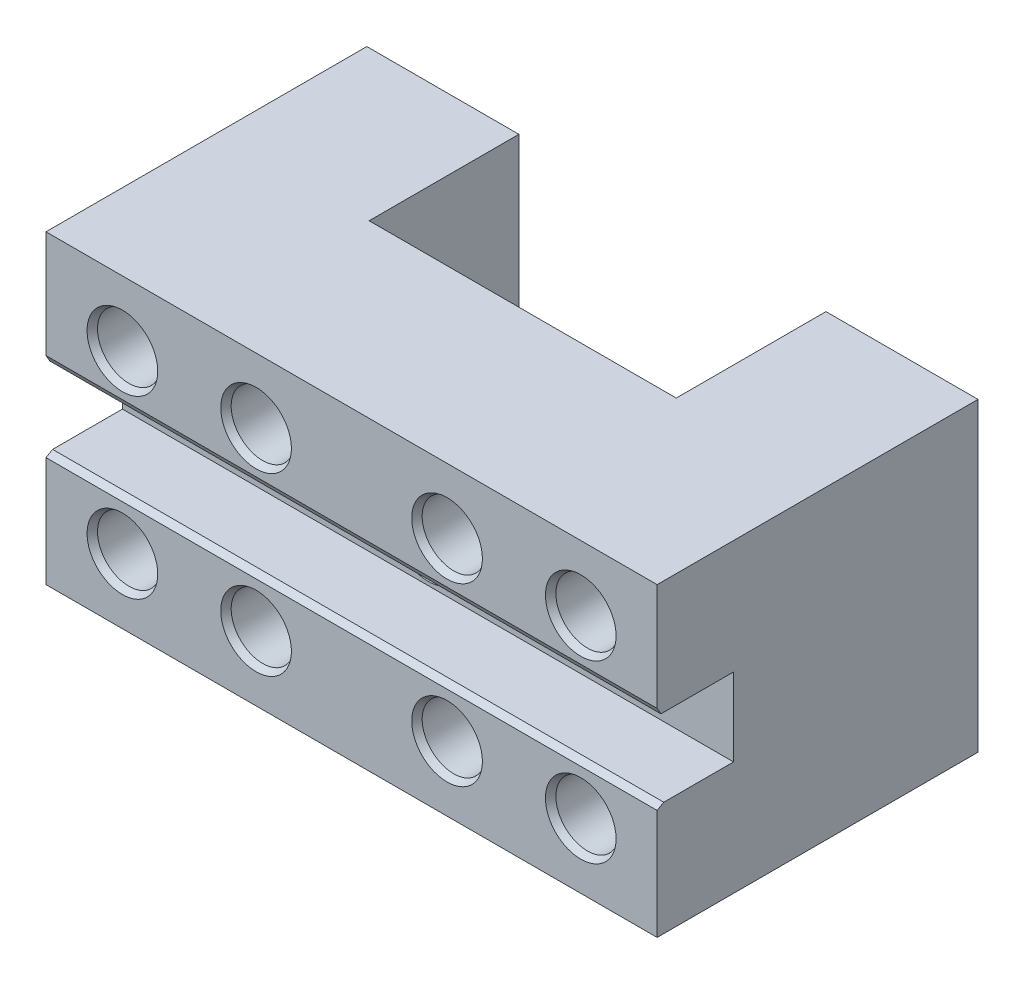
ISO-10303-21;
HEADER;
FILE_DESCRIPTION(('STEP AP214'),'2;1');
FILE_NAME('part.step','',(''),(''),'','','');
FILE_SCHEMA(('AUTOMOTIVE_DESIGN { 1 0 10303 214 1 1 1 1 }'));
ENDSEC;
DATA;
#1=APPLICATION_CONTEXT('core data for automotive mechanical design processes');
#2=APPLICATION_PROTOCOL_DEFINITION('international standard','automotive_design',2000,#1);
#3=PRODUCT_CONTEXT('',#1,'mechanical');
#4=PRODUCT('Part','Part','',(#3));
#5=PRODUCT_RELATED_PRODUCT_CATEGORY('part','',(#4));
#6=PRODUCT_DEFINITION_FORMATION('','',#4);
#7=PRODUCT_DEFINITION_CONTEXT('part definition',#1,'design');
#8=PRODUCT_DEFINITION('design','',#6,#7);
#9=PRODUCT_DEFINITION_SHAPE('','',#8);
#10=(LENGTH_UNIT() NAMED_UNIT(*) SI_UNIT(.MILLI.,.METRE.));
#11=(NAMED_UNIT(*) PLANE_ANGLE_UNIT() SI_UNIT($,.RADIAN.));
#12=(NAMED_UNIT(*) SI_UNIT($,.STERADIAN.) SOLID_ANGLE_UNIT());
#13=UNCERTAINTY_MEASURE_WITH_UNIT(LENGTH_MEASURE(1.E-05),#10,'distance_accuracy_value','');
#14=(GEOMETRIC_REPRESENTATION_CONTEXT(3) GLOBAL_UNCERTAINTY_ASSIGNED_CONTEXT((#13)) GLOBAL_UNIT_ASSIGNED_CONTEXT((#10,
#11,#12)) REPRESENTATION_CONTEXT('',''));
#15=CARTESIAN_POINT('',(0.,0.,0.));
#16=DIRECTION('',(0.,0.,1.));
#17=DIRECTION('',(1.,0.,0.));
#18=AXIS2_PLACEMENT_3D('',#15,#16,#17);
#19=CARTESIAN_POINT('',(-11.4121037463977,40.,-30.));
#20=DIRECTION('',(0.,0.,1.));
#21=DIRECTION('',(1.,0.,0.));
#22=AXIS2_PLACEMENT_3D('',#19,#20,#21);
#23=PLANE('',#22);
#24=CARTESIAN_POINT('',(-21.3121037463977,8.5,-30.));
#25=DIRECTION('',(0.,0.,1.));
#26=DIRECTION('',(1.,0.,0.));
#27=AXIS2_PLACEMENT_3D('',#24,#25,#26);
#28=CIRCLE('',#27,4.125);
#29=CARTESIAN_POINT('',(-17.1871037463977,8.5,-30.));
#30=VERTEX_POINT('',#29);
#31=EDGE_CURVE('E337',#30,#30,#28,.T.);
#32=ORIENTED_EDGE('',*,*,#31,.T.);
#33=EDGE_LOOP('',(#32));
#34=FACE_BOUND('',#33,.T.);
#35=CARTESIAN_POINT('',(-21.3121037463977,31.5,-30.));
#36=DIRECTION('',(0.,0.,1.));
#37=DIRECTION('',(1.,0.,0.));
#38=AXIS2_PLACEMENT_3D('',#35,#36,#37);
#39=CIRCLE('',#38,4.125);
#40=CARTESIAN_POINT('',(-17.1871037463977,31.5,-30.));
#41=VERTEX_POINT('',#40);
#42=EDGE_CURVE('E334',#41,#41,#39,.T.);
#43=ORIENTED_EDGE('',*,*,#42,.T.);
#44=EDGE_LOOP('',(#43));
#45=FACE_BOUND('',#44,.T.);
#46=DIRECTION('',(-1.,0.,0.));
#47=VECTOR('',#46,1.);
#48=CARTESIAN_POINT('',(-11.4121037463977,0.,-30.));
#49=LINE('',#48,#47);
#50=CARTESIAN_POINT('',(-11.4121037463977,0.,-30.));
#51=VERTEX_POINT('',#50);
#52=CARTESIAN_POINT('',(-31.3121037463977,0.,-30.));
#53=VERTEX_POINT('',#52);
#54=EDGE_CURVE('E203',#51,#53,#49,.T.);
#55=ORIENTED_EDGE('',*,*,#54,.T.);
#56=DIRECTION('',(0.,-1.,0.));
#57=VECTOR('',#56,1.);
#58=CARTESIAN_POINT('',(-31.3121037463977,40.,-30.));
#59=LINE('',#58,#57);
#60=CARTESIAN_POINT('',(-31.3121037463977,40.,-30.));
#61=VERTEX_POINT('',#60);
#62=EDGE_CURVE('E229',#61,#53,#59,.T.);
#63=ORIENTED_EDGE('',*,*,#62,.F.);
#64=DIRECTION('',(-1.,0.,0.));
#65=VECTOR('',#64,1.);
#66=CARTESIAN_POINT('',(-11.4121037463977,40.,-30.));
#67=LINE('',#66,#65);
#68=CARTESIAN_POINT('',(-11.4121037463977,40.,-30.));
#69=VERTEX_POINT('',#68);
#70=EDGE_CURVE('E191',#69,#61,#67,.T.);
#71=ORIENTED_EDGE('',*,*,#70,.F.);
#72=DIRECTION('',(0.,-1.,0.));
#73=VECTOR('',#72,1.);
#74=CARTESIAN_POINT('',(-11.4121037463977,40.,-30.));
#75=LINE('',#74,#73);
#76=EDGE_CURVE('E202',#69,#51,#75,.T.);
#77=ORIENTED_EDGE('',*,*,#76,.T.);
#78=EDGE_LOOP('',(#55,#63,#71,#77));
#79=FACE_BOUND('',#78,.T.);
#80=ADVANCED_FACE('F35',(#34,#45,#79),#23,.F.);
#81=CARTESIAN_POINT('',(-31.3121037463977,40.,-30.));
#82=DIRECTION('',(1.,0.,0.));
#83=DIRECTION('',(0.,0.,-1.));
#84=AXIS2_PLACEMENT_3D('',#81,#82,#83);
#85=PLANE('',#84);
#86=DIRECTION('',(0.,0.,1.));
#87=VECTOR('',#86,1.);
#88=CARTESIAN_POINT('',(-31.3121037463977,25.1,2.));
#89=LINE('',#88,#87);
#90=CARTESIAN_POINT('',(-31.3121037463977,25.1,2.));
#91=VERTEX_POINT('',#90);
#92=CARTESIAN_POINT('',(-31.3121037463977,25.1,11.5));
#93=VERTEX_POINT('',#92);
#94=EDGE_CURVE('E296',#91,#93,#89,.T.);
#95=ORIENTED_EDGE('',*,*,#94,.T.);
#96=DIRECTION('',(0.,-0.866025403784438,-0.500000000000001));
#97=VECTOR('',#96,1.);
#98=CARTESIAN_POINT('',(-31.3121037463977,25.9660254037844,12.));
#99=LINE('',#98,#97);
#100=CARTESIAN_POINT('',(-31.3121037463977,25.9660254037844,12.));
#101=VERTEX_POINT('',#100);
#102=EDGE_CURVE('E43',#93,#101,#99,.F.);
#103=ORIENTED_EDGE('',*,*,#102,.T.);
#104=DIRECTION('',(0.,1.,0.));
#105=VECTOR('',#104,1.);
#106=CARTESIAN_POINT('',(-31.3121037463977,25.1,12.));
#107=LINE('',#106,#105);
#108=CARTESIAN_POINT('',(-31.3121037463977,40.,12.));
#109=VERTEX_POINT('',#108);
#110=EDGE_CURVE('E186',#101,#109,#107,.T.);
#111=ORIENTED_EDGE('',*,*,#110,.T.);
#112=DIRECTION('',(0.,0.,1.));
#113=VECTOR('',#112,1.);
#114=CARTESIAN_POINT('',(-31.3121037463977,40.,-30.));
#115=LINE('',#114,#113);
#116=EDGE_CURVE('E149',#61,#109,#115,.T.);
#117=ORIENTED_EDGE('',*,*,#116,.F.);
#118=ORIENTED_EDGE('',*,*,#62,.T.);
#119=DIRECTION('',(0.,0.,1.));
#120=VECTOR('',#119,1.);
#121=CARTESIAN_POINT('',(-31.3121037463977,0.,-30.));
#122=LINE('',#121,#120);
#123=CARTESIAN_POINT('',(-31.3121037463977,0.,12.));
#124=VERTEX_POINT('',#123);
#125=EDGE_CURVE('E206',#53,#124,#122,.T.);
#126=ORIENTED_EDGE('',*,*,#125,.T.);
#127=DIRECTION('',(0.,1.,0.));
#128=VECTOR('',#127,1.);
#129=CARTESIAN_POINT('',(-31.3121037463977,0.,12.));
#130=LINE('',#129,#128);
#131=CARTESIAN_POINT('',(-31.3121037463977,14.4,12.));
#132=VERTEX_POINT('',#131);
#133=EDGE_CURVE('E174',#124,#132,#130,.T.);
#134=ORIENTED_EDGE('',*,*,#133,.T.);
#135=DIRECTION('',(0.,-0.499999999999999,0.86602540378444));
#136=VECTOR('',#135,1.);
#137=CARTESIAN_POINT('',(-31.3121037463977,14.9,11.1339745962156));
#138=LINE('',#137,#136);
#139=CARTESIAN_POINT('',(-31.3121037463977,14.9,11.1339745962156));
#140=VERTEX_POINT('',#139);
#141=EDGE_CURVE('E50',#132,#140,#138,.F.);
#142=ORIENTED_EDGE('',*,*,#141,.T.);
#143=DIRECTION('',(0.,0.,-1.));
#144=VECTOR('',#143,1.);
#145=CARTESIAN_POINT('',(-31.3121037463977,14.9,12.));
#146=LINE('',#145,#144);
#147=CARTESIAN_POINT('',(-31.3121037463977,14.9,2.));
#148=VERTEX_POINT('',#147);
#149=EDGE_CURVE('E312',#140,#148,#146,.T.);
#150=ORIENTED_EDGE('',*,*,#149,.T.);
#151=DIRECTION('',(0.,1.,0.));
#152=VECTOR('',#151,1.);
#153=CARTESIAN_POINT('',(-31.3121037463977,14.9,2.));
#154=LINE('',#153,#152);
#155=EDGE_CURVE('E319',#148,#91,#154,.T.);
#156=ORIENTED_EDGE('',*,*,#155,.T.);
#157=EDGE_LOOP('',(#95,#103,#111,#117,#118,#126,#134,#142,#150,#156));
#158=FACE_BOUND('',#157,.T.);
#159=ADVANCED_FACE('F295',(#158),#85,.F.);
#160=CARTESIAN_POINT('',(48.6878962536023,40.,0.));
#161=DIRECTION('',(-1.,0.,0.));
#162=DIRECTION('',(0.,0.,1.));
#163=AXIS2_PLACEMENT_3D('',#160,#161,#162);
#164=PLANE('',#163);
#165=DIRECTION('',(0.,-1.,0.));
#166=VECTOR('',#165,1.);
#167=CARTESIAN_POINT('',(48.6878962536023,25.1,12.));
#168=LINE('',#167,#166);
#169=CARTESIAN_POINT('',(48.6878962536023,40.,12.));
#170=VERTEX_POINT('',#169);
#171=CARTESIAN_POINT('',(48.6878962536023,25.9660254037844,12.));
#172=VERTEX_POINT('',#171);
#173=EDGE_CURVE('E143',#170,#172,#168,.T.);
#174=ORIENTED_EDGE('',*,*,#173,.T.);
#175=DIRECTION('',(0.,0.866025403784438,0.500000000000001));
#176=VECTOR('',#175,1.);
#177=CARTESIAN_POINT('',(48.6878962536023,25.9660254037844,12.));
#178=LINE('',#177,#176);
#179=CARTESIAN_POINT('',(48.6878962536023,25.1,11.5));
#180=VERTEX_POINT('',#179);
#181=EDGE_CURVE('E291',#172,#180,#178,.F.);
#182=ORIENTED_EDGE('',*,*,#181,.T.);
#183=DIRECTION('',(0.,0.,-1.));
#184=VECTOR('',#183,1.);
#185=CARTESIAN_POINT('',(48.6878962536023,25.1,2.));
#186=LINE('',#185,#184);
#187=CARTESIAN_POINT('',(48.6878962536023,25.1,2.));
#188=VERTEX_POINT('',#187);
#189=EDGE_CURVE('E165',#180,#188,#186,.T.);
#190=ORIENTED_EDGE('',*,*,#189,.T.);
#191=DIRECTION('',(0.,-1.,0.));
#192=VECTOR('',#191,1.);
#193=CARTESIAN_POINT('',(48.6878962536023,14.9,2.));
#194=LINE('',#193,#192);
#195=CARTESIAN_POINT('',(48.6878962536023,14.9,2.));
#196=VERTEX_POINT('',#195);
#197=EDGE_CURVE('E168',#188,#196,#194,.T.);
#198=ORIENTED_EDGE('',*,*,#197,.T.);
#199=DIRECTION('',(0.,0.,1.));
#200=VECTOR('',#199,1.);
#201=CARTESIAN_POINT('',(48.6878962536023,14.9,12.));
#202=LINE('',#201,#200);
#203=CARTESIAN_POINT('',(48.6878962536023,14.9,11.1339745962156));
#204=VERTEX_POINT('',#203);
#205=EDGE_CURVE('E179',#196,#204,#202,.T.);
#206=ORIENTED_EDGE('',*,*,#205,.T.);
#207=DIRECTION('',(0.,0.499999999999999,-0.86602540378444));
#208=VECTOR('',#207,1.);
#209=CARTESIAN_POINT('',(48.6878962536023,14.9,11.1339745962156));
#210=LINE('',#209,#208);
#211=CARTESIAN_POINT('',(48.6878962536023,14.4,12.));
#212=VERTEX_POINT('',#211);
#213=EDGE_CURVE('E289',#204,#212,#210,.F.);
#214=ORIENTED_EDGE('',*,*,#213,.T.);
#215=DIRECTION('',(0.,-1.,0.));
#216=VECTOR('',#215,1.);
#217=CARTESIAN_POINT('',(48.6878962536023,0.,12.));
#218=LINE('',#217,#216);
#219=CARTESIAN_POINT('',(48.6878962536023,0.,12.));
#220=VERTEX_POINT('',#219);
#221=EDGE_CURVE('E159',#212,#220,#218,.T.);
#222=ORIENTED_EDGE('',*,*,#221,.T.);
#223=DIRECTION('',(0.,0.,-1.));
#224=VECTOR('',#223,1.);
#225=CARTESIAN_POINT('',(48.6878962536023,0.,0.));
#226=LINE('',#225,#224);
#227=CARTESIAN_POINT('',(48.6878962536023,0.,-30.));
#228=VERTEX_POINT('',#227);
#229=EDGE_CURVE('E208',#220,#228,#226,.T.);
#230=ORIENTED_EDGE('',*,*,#229,.T.);
#231=DIRECTION('',(0.,-1.,0.));
#232=VECTOR('',#231,1.);
#233=CARTESIAN_POINT('',(48.6878962536023,40.,-30.));
#234=LINE('',#233,#232);
#235=CARTESIAN_POINT('',(48.6878962536023,40.,-30.));
#236=VERTEX_POINT('',#235);
#237=EDGE_CURVE('E145',#236,#228,#234,.T.);
#238=ORIENTED_EDGE('',*,*,#237,.F.);
#239=DIRECTION('',(0.,0.,-1.));
#240=VECTOR('',#239,1.);
#241=CARTESIAN_POINT('',(48.6878962536023,40.,0.));
#242=LINE('',#241,#240);
#243=EDGE_CURVE('E139',#170,#236,#242,.T.);
#244=ORIENTED_EDGE('',*,*,#243,.F.);
#245=EDGE_LOOP('',(#174,#182,#190,#198,#206,#214,#222,#230,#238,#244));
#246=FACE_BOUND('',#245,.T.);
#247=ADVANCED_FACE('F141',(#246),#164,.F.);
#248=CARTESIAN_POINT('',(48.6878962536023,40.,-30.));
#249=DIRECTION('',(0.,0.,1.));
#250=DIRECTION('',(1.,0.,0.));
#251=AXIS2_PLACEMENT_3D('',#248,#249,#250);
#252=PLANE('',#251);
#253=CARTESIAN_POINT('',(38.6878962536023,31.5,-30.));
#254=DIRECTION('',(0.,0.,1.));
#255=DIRECTION('',(1.,0.,0.));
#256=AXIS2_PLACEMENT_3D('',#253,#254,#255);
#257=CIRCLE('',#256,4.12500000000001);
#258=CARTESIAN_POINT('',(42.8128962536023,31.5,-30.));
#259=VERTEX_POINT('',#258);
#260=EDGE_CURVE('E338',#259,#259,#257,.T.);
#261=ORIENTED_EDGE('',*,*,#260,.T.);
#262=EDGE_LOOP('',(#261));
#263=FACE_BOUND('',#262,.T.);
#264=CARTESIAN_POINT('',(38.6878962536023,8.50000000000001,-30.));
#265=DIRECTION('',(0.,0.,1.));
#266=DIRECTION('',(1.,0.,0.));
#267=AXIS2_PLACEMENT_3D('',#264,#265,#266);
#268=CIRCLE('',#267,4.12500000000001);
#269=CARTESIAN_POINT('',(42.8128962536023,8.50000000000001,-30.));
#270=VERTEX_POINT('',#269);
#271=EDGE_CURVE('E341',#270,#270,#268,.T.);
#272=ORIENTED_EDGE('',*,*,#271,.T.);
#273=EDGE_LOOP('',(#272));
#274=FACE_BOUND('',#273,.T.);
#275=DIRECTION('',(-1.,0.,0.));
#276=VECTOR('',#275,1.);
#277=CARTESIAN_POINT('',(48.6878962536023,0.,-30.));
#278=LINE('',#277,#276);
#279=CARTESIAN_POINT('',(28.7878962536023,0.,-30.));
#280=VERTEX_POINT('',#279);
#281=EDGE_CURVE('E210',#228,#280,#278,.T.);
#282=ORIENTED_EDGE('',*,*,#281,.T.);
#283=DIRECTION('',(0.,-1.,0.));
#284=VECTOR('',#283,1.);
#285=CARTESIAN_POINT('',(28.7878962536023,40.,-30.));
#286=LINE('',#285,#284);
#287=CARTESIAN_POINT('',(28.7878962536023,40.,-30.));
#288=VERTEX_POINT('',#287);
#289=EDGE_CURVE('E225',#288,#280,#286,.T.);
#290=ORIENTED_EDGE('',*,*,#289,.F.);
#291=DIRECTION('',(-1.,0.,0.));
#292=VECTOR('',#291,1.);
#293=CARTESIAN_POINT('',(48.6878962536023,40.,-30.));
#294=LINE('',#293,#292);
#295=EDGE_CURVE('E148',#236,#288,#294,.T.);
#296=ORIENTED_EDGE('',*,*,#295,.F.);
#297=ORIENTED_EDGE('',*,*,#237,.T.);
#298=EDGE_LOOP('',(#282,#290,#296,#297));
#299=FACE_BOUND('',#298,.T.);
#300=ADVANCED_FACE('F631',(#263,#274,#299),#252,.F.);
#301=CARTESIAN_POINT('',(28.7878962536023,40.,-30.));
#302=DIRECTION('',(1.,0.,0.));
#303=DIRECTION('',(0.,0.,-1.));
#304=AXIS2_PLACEMENT_3D('',#301,#302,#303);
#305=PLANE('',#304);
#306=DIRECTION('',(0.,0.,1.));
#307=VECTOR('',#306,1.);
#308=CARTESIAN_POINT('',(28.7878962536023,0.,-30.));
#309=LINE('',#308,#307);
#310=CARTESIAN_POINT('',(28.7878962536023,0.,-10.4));
#311=VERTEX_POINT('',#310);
#312=EDGE_CURVE('E212',#280,#311,#309,.T.);
#313=ORIENTED_EDGE('',*,*,#312,.T.);
#314=DIRECTION('',(0.,-1.,0.));
#315=VECTOR('',#314,1.);
#316=CARTESIAN_POINT('',(28.7878962536023,40.,-10.4));
#317=LINE('',#316,#315);
#318=CARTESIAN_POINT('',(28.7878962536023,40.,-10.4));
#319=VERTEX_POINT('',#318);
#320=EDGE_CURVE('E222',#319,#311,#317,.T.);
#321=ORIENTED_EDGE('',*,*,#320,.F.);
#322=DIRECTION('',(0.,0.,1.));
#323=VECTOR('',#322,1.);
#324=CARTESIAN_POINT('',(28.7878962536023,40.,-30.));
#325=LINE('',#324,#323);
#326=EDGE_CURVE('E196',#288,#319,#325,.T.);
#327=ORIENTED_EDGE('',*,*,#326,.F.);
#328=ORIENTED_EDGE('',*,*,#289,.T.);
#329=EDGE_LOOP('',(#313,#321,#327,#328));
#330=FACE_BOUND('',#329,.T.);
#331=ADVANCED_FACE('F623',(#330),#305,.F.);
#332=CARTESIAN_POINT('',(28.7878962536023,40.,-10.4));
#333=DIRECTION('',(0.,0.,1.));
#334=DIRECTION('',(1.,0.,0.));
#335=AXIS2_PLACEMENT_3D('',#332,#333,#334);
#336=PLANE('',#335);
#337=CARTESIAN_POINT('',(8.68789625360231,20.,-10.4));
#338=DIRECTION('',(0.,0.,1.));
#339=DIRECTION('',(1.,0.,0.));
#340=AXIS2_PLACEMENT_3D('',#337,#338,#339);
#341=CIRCLE('',#340,4.125);
#342=CARTESIAN_POINT('',(12.8128962536023,20.,-10.4));
#343=VERTEX_POINT('',#342);
#344=EDGE_CURVE('E328',#343,#343,#341,.T.);
#345=ORIENTED_EDGE('',*,*,#344,.T.);
#346=EDGE_LOOP('',(#345));
#347=FACE_BOUND('',#346,.T.);
#348=CARTESIAN_POINT('',(-3.8121037463977,8.50000000000001,-10.4));
#349=DIRECTION('',(0.,0.,1.));
#350=DIRECTION('',(1.,0.,0.));
#351=AXIS2_PLACEMENT_3D('',#348,#349,#350);
#352=CIRCLE('',#351,4.125);
#353=CARTESIAN_POINT('',(0.312896253602301,8.50000000000001,-10.4));
#354=VERTEX_POINT('',#353);
#355=EDGE_CURVE('E171',#354,#354,#352,.T.);
#356=ORIENTED_EDGE('',*,*,#355,.T.);
#357=EDGE_LOOP('',(#356));
#358=FACE_BOUND('',#357,.T.);
#359=CARTESIAN_POINT('',(21.1878962536023,8.50000000000001,-10.4));
#360=DIRECTION('',(0.,0.,1.));
#361=DIRECTION('',(1.,0.,0.));
#362=AXIS2_PLACEMENT_3D('',#359,#360,#361);
#363=CIRCLE('',#362,4.125);
#364=CARTESIAN_POINT('',(25.3128962536023,8.50000000000001,-10.4));
#365=VERTEX_POINT('',#364);
#366=EDGE_CURVE('E325',#365,#365,#363,.T.);
#367=ORIENTED_EDGE('',*,*,#366,.T.);
#368=EDGE_LOOP('',(#367));
#369=FACE_BOUND('',#368,.T.);
#370=CARTESIAN_POINT('',(21.1878962536023,31.5,-10.4));
#371=DIRECTION('',(0.,0.,1.));
#372=DIRECTION('',(1.,0.,0.));
#373=AXIS2_PLACEMENT_3D('',#370,#371,#372);
#374=CIRCLE('',#373,4.125);
#375=CARTESIAN_POINT('',(25.3128962536023,31.5,-10.4));
#376=VERTEX_POINT('',#375);
#377=EDGE_CURVE('E331',#376,#376,#374,.T.);
#378=ORIENTED_EDGE('',*,*,#377,.T.);
#379=EDGE_LOOP('',(#378));
#380=FACE_BOUND('',#379,.T.);
#381=CARTESIAN_POINT('',(-3.8121037463977,31.5,-10.4));
#382=DIRECTION('',(0.,0.,1.));
#383=DIRECTION('',(1.,0.,0.));
#384=AXIS2_PLACEMENT_3D('',#381,#382,#383);
#385=CIRCLE('',#384,4.125);
#386=CARTESIAN_POINT('',(0.312896253602301,31.5,-10.4));
#387=VERTEX_POINT('',#386);
#388=EDGE_CURVE('E166',#387,#387,#385,.T.);
#389=ORIENTED_EDGE('',*,*,#388,.T.);
#390=EDGE_LOOP('',(#389));
#391=FACE_BOUND('',#390,.T.);
#392=DIRECTION('',(-1.,0.,0.));
#393=VECTOR('',#392,1.);
#394=CARTESIAN_POINT('',(28.7878962536023,0.,-10.4));
#395=LINE('',#394,#393);
#396=CARTESIAN_POINT('',(-11.4121037463977,0.,-10.4));
#397=VERTEX_POINT('',#396);
#398=EDGE_CURVE('E214',#311,#397,#395,.T.);
#399=ORIENTED_EDGE('',*,*,#398,.T.);
#400=DIRECTION('',(0.,-1.,0.));
#401=VECTOR('',#400,1.);
#402=CARTESIAN_POINT('',(-11.4121037463977,40.,-10.4));
#403=LINE('',#402,#401);
#404=CARTESIAN_POINT('',(-11.4121037463977,40.,-10.4));
#405=VERTEX_POINT('',#404);
#406=EDGE_CURVE('E219',#405,#397,#403,.T.);
#407=ORIENTED_EDGE('',*,*,#406,.F.);
#408=DIRECTION('',(-1.,0.,0.));
#409=VECTOR('',#408,1.);
#410=CARTESIAN_POINT('',(28.7878962536023,40.,-10.4));
#411=LINE('',#410,#409);
#412=EDGE_CURVE('E198',#319,#405,#411,.T.);
#413=ORIENTED_EDGE('',*,*,#412,.F.);
#414=ORIENTED_EDGE('',*,*,#320,.T.);
#415=EDGE_LOOP('',(#399,#407,#413,#414));
#416=FACE_BOUND('',#415,.T.);
#417=ADVANCED_FACE('F614',(#347,#358,#369,#380,#391,#416),#336,.F.);
#418=CARTESIAN_POINT('',(-11.4121037463977,40.,-10.4));
#419=DIRECTION('',(-1.,0.,0.));
#420=DIRECTION('',(0.,0.,1.));
#421=AXIS2_PLACEMENT_3D('',#418,#419,#420);
#422=PLANE('',#421);
#423=DIRECTION('',(0.,0.,-1.));
#424=VECTOR('',#423,1.);
#425=CARTESIAN_POINT('',(-11.4121037463977,0.,-10.4));
#426=LINE('',#425,#424);
#427=EDGE_CURVE('E193',#397,#51,#426,.T.);
#428=ORIENTED_EDGE('',*,*,#427,.T.);
#429=ORIENTED_EDGE('',*,*,#76,.F.);
#430=DIRECTION('',(0.,0.,-1.));
#431=VECTOR('',#430,1.);
#432=CARTESIAN_POINT('',(-11.4121037463977,40.,-10.4));
#433=LINE('',#432,#431);
#434=EDGE_CURVE('E200',#405,#69,#433,.T.);
#435=ORIENTED_EDGE('',*,*,#434,.F.);
#436=ORIENTED_EDGE('',*,*,#406,.T.);
#437=EDGE_LOOP('',(#428,#429,#435,#436));
#438=FACE_BOUND('',#437,.T.);
#439=ADVANCED_FACE('F607',(#438),#422,.F.);
#440=CARTESIAN_POINT('',(0.,40.,0.));
#441=DIRECTION('',(0.,1.,0.));
#442=DIRECTION('',(0.,0.,1.));
#443=AXIS2_PLACEMENT_3D('',#440,#441,#442);
#444=PLANE('',#443);
#445=ORIENTED_EDGE('',*,*,#70,.T.);
#446=ORIENTED_EDGE('',*,*,#116,.T.);
#447=DIRECTION('',(1.,0.,0.));
#448=VECTOR('',#447,1.);
#449=CARTESIAN_POINT('',(-73.0733297820399,40.,12.));
#450=LINE('',#449,#448);
#451=EDGE_CURVE('E153',#109,#170,#450,.T.);
#452=ORIENTED_EDGE('',*,*,#451,.T.);
#453=ORIENTED_EDGE('',*,*,#243,.T.);
#454=ORIENTED_EDGE('',*,*,#295,.T.);
#455=ORIENTED_EDGE('',*,*,#326,.T.);
#456=ORIENTED_EDGE('',*,*,#412,.T.);
#457=ORIENTED_EDGE('',*,*,#434,.T.);
#458=EDGE_LOOP('',(#445,#446,#452,#453,#454,#455,#456,#457));
#459=FACE_BOUND('',#458,.T.);
#460=ADVANCED_FACE('F155',(#459),#444,.T.);
#461=CARTESIAN_POINT('',(0.,0.,0.));
#462=DIRECTION('',(0.,1.,0.));
#463=DIRECTION('',(0.,0.,1.));
#464=AXIS2_PLACEMENT_3D('',#461,#462,#463);
#465=PLANE('',#464);
#466=ORIENTED_EDGE('',*,*,#54,.F.);
#467=ORIENTED_EDGE('',*,*,#427,.F.);
#468=ORIENTED_EDGE('',*,*,#398,.F.);
#469=ORIENTED_EDGE('',*,*,#312,.F.);
#470=ORIENTED_EDGE('',*,*,#281,.F.);
#471=ORIENTED_EDGE('',*,*,#229,.F.);
#472=DIRECTION('',(1.,0.,0.));
#473=VECTOR('',#472,1.);
#474=CARTESIAN_POINT('',(-73.0733297820399,0.,12.));
#475=LINE('',#474,#473);
#476=EDGE_CURVE('E183',#124,#220,#475,.T.);
#477=ORIENTED_EDGE('',*,*,#476,.F.);
#478=ORIENTED_EDGE('',*,*,#125,.F.);
#479=EDGE_LOOP('',(#466,#467,#468,#469,#470,#471,#477,#478));
#480=FACE_BOUND('',#479,.T.);
#481=ADVANCED_FACE('F590',(#480),#465,.F.);
#482=CARTESIAN_POINT('',(-73.0733297820399,0.,12.));
#483=DIRECTION('',(0.,0.,1.));
#484=DIRECTION('',(1.,0.,0.));
#485=AXIS2_PLACEMENT_3D('',#482,#483,#484);
#486=PLANE('',#485);
#487=CARTESIAN_POINT('',(38.6878962536023,8.50000000000001,12.));
#488=DIRECTION('',(0.,0.,1.));
#489=DIRECTION('',(1.,0.,0.));
#490=AXIS2_PLACEMENT_3D('',#487,#488,#489);
#491=CIRCLE('',#490,4.62500000000001);
#492=CARTESIAN_POINT('',(43.3128962536023,8.50000000000001,12.));
#493=VERTEX_POINT('',#492);
#494=EDGE_CURVE('E246',#493,#493,#491,.F.);
#495=ORIENTED_EDGE('',*,*,#494,.T.);
#496=EDGE_LOOP('',(#495));
#497=FACE_BOUND('',#496,.T.);
#498=CARTESIAN_POINT('',(21.1878962536023,8.50000000000001,12.));
#499=DIRECTION('',(0.,0.,1.));
#500=DIRECTION('',(1.,0.,0.));
#501=AXIS2_PLACEMENT_3D('',#498,#499,#500);
#502=CIRCLE('',#501,4.62500000000001);
#503=CARTESIAN_POINT('',(25.8128962536023,8.50000000000001,12.));
#504=VERTEX_POINT('',#503);
#505=EDGE_CURVE('E243',#504,#504,#502,.F.);
#506=ORIENTED_EDGE('',*,*,#505,.T.);
#507=EDGE_LOOP('',(#506));
#508=FACE_BOUND('',#507,.T.);
#509=CARTESIAN_POINT('',(-3.8121037463977,8.50000000000001,12.));
#510=DIRECTION('',(0.,0.,1.));
#511=DIRECTION('',(1.,0.,0.));
#512=AXIS2_PLACEMENT_3D('',#509,#510,#511);
#513=CIRCLE('',#512,4.62500000000001);
#514=CARTESIAN_POINT('',(0.812896253602311,8.50000000000001,12.));
#515=VERTEX_POINT('',#514);
#516=EDGE_CURVE('E240',#515,#515,#513,.F.);
#517=ORIENTED_EDGE('',*,*,#516,.T.);
#518=EDGE_LOOP('',(#517));
#519=FACE_BOUND('',#518,.T.);
#520=CARTESIAN_POINT('',(-21.3121037463977,8.5,12.));
#521=DIRECTION('',(0.,0.,1.));
#522=DIRECTION('',(1.,0.,0.));
#523=AXIS2_PLACEMENT_3D('',#520,#521,#522);
#524=CIRCLE('',#523,4.62500000000001);
#525=CARTESIAN_POINT('',(-16.6871037463977,8.5,12.));
#526=VERTEX_POINT('',#525);
#527=EDGE_CURVE('E237',#526,#526,#524,.F.);
#528=ORIENTED_EDGE('',*,*,#527,.T.);
#529=EDGE_LOOP('',(#528));
#530=FACE_BOUND('',#529,.T.);
#531=ORIENTED_EDGE('',*,*,#221,.F.);
#532=DIRECTION('',(-1.,0.,0.));
#533=VECTOR('',#532,1.);
#534=CARTESIAN_POINT('',(-73.0733297820399,14.4,12.));
#535=LINE('',#534,#533);
#536=EDGE_CURVE('E235',#212,#132,#535,.T.);
#537=ORIENTED_EDGE('',*,*,#536,.T.);
#538=ORIENTED_EDGE('',*,*,#133,.F.);
#539=ORIENTED_EDGE('',*,*,#476,.T.);
#540=EDGE_LOOP('',(#531,#537,#538,#539));
#541=FACE_BOUND('',#540,.T.);
#542=ADVANCED_FACE('F317',(#497,#508,#519,#530,#541),#486,.T.);
#543=CARTESIAN_POINT('',(-73.0733297820399,14.9,12.));
#544=DIRECTION('',(0.,1.,0.));
#545=DIRECTION('',(0.,0.,1.));
#546=AXIS2_PLACEMENT_3D('',#543,#544,#545);
#547=PLANE('',#546);
#548=ORIENTED_EDGE('',*,*,#149,.F.);
#549=DIRECTION('',(1.,0.,0.));
#550=VECTOR('',#549,1.);
#551=CARTESIAN_POINT('',(-73.0733297820399,14.9,11.1339745962156));
#552=LINE('',#551,#550);
#553=EDGE_CURVE('E11',#140,#204,#552,.T.);
#554=ORIENTED_EDGE('',*,*,#553,.T.);
#555=ORIENTED_EDGE('',*,*,#205,.F.);
#556=DIRECTION('',(1.,0.,0.));
#557=VECTOR('',#556,1.);
#558=CARTESIAN_POINT('',(-73.0733297820399,14.9,2.));
#559=LINE('',#558,#557);
#560=EDGE_CURVE('E187',#148,#196,#559,.T.);
#561=ORIENTED_EDGE('',*,*,#560,.F.);
#562=EDGE_LOOP('',(#548,#554,#555,#561));
#563=FACE_BOUND('',#562,.T.);
#564=ADVANCED_FACE('F310',(#563),#547,.T.);
#565=CARTESIAN_POINT('',(-73.0733297820399,14.9,2.));
#566=DIRECTION('',(0.,0.,1.));
#567=DIRECTION('',(1.,0.,0.));
#568=AXIS2_PLACEMENT_3D('',#565,#566,#567);
#569=PLANE('',#568);
#570=CARTESIAN_POINT('',(8.68789625360231,20.,2.));
#571=DIRECTION('',(0.,0.,1.));
#572=DIRECTION('',(1.,0.,0.));
#573=AXIS2_PLACEMENT_3D('',#570,#571,#572);
#574=CIRCLE('',#573,4.62500000000001);
#575=CARTESIAN_POINT('',(13.3128962536023,20.,2.));
#576=VERTEX_POINT('',#575);
#577=EDGE_CURVE('E277',#576,#576,#574,.F.);
#578=ORIENTED_EDGE('',*,*,#577,.T.);
#579=EDGE_LOOP('',(#578));
#580=FACE_BOUND('',#579,.T.);
#581=ORIENTED_EDGE('',*,*,#155,.F.);
#582=ORIENTED_EDGE('',*,*,#560,.T.);
#583=ORIENTED_EDGE('',*,*,#197,.F.);
#584=DIRECTION('',(1.,0.,0.));
#585=VECTOR('',#584,1.);
#586=CARTESIAN_POINT('',(-73.0733297820399,25.1,2.));
#587=LINE('',#586,#585);
#588=EDGE_CURVE('E158',#91,#188,#587,.T.);
#589=ORIENTED_EDGE('',*,*,#588,.F.);
#590=EDGE_LOOP('',(#581,#582,#583,#589));
#591=FACE_BOUND('',#590,.T.);
#592=ADVANCED_FACE('F305',(#580,#591),#569,.T.);
#593=CARTESIAN_POINT('',(-73.0733297820399,25.1,2.));
#594=DIRECTION('',(0.,-1.,0.));
#595=DIRECTION('',(0.,0.,-1.));
#596=AXIS2_PLACEMENT_3D('',#593,#594,#595);
#597=PLANE('',#596);
#598=ORIENTED_EDGE('',*,*,#189,.F.);
#599=DIRECTION('',(-1.,0.,0.));
#600=VECTOR('',#599,1.);
#601=CARTESIAN_POINT('',(-73.0733297820399,25.1,11.5));
#602=LINE('',#601,#600);
#603=EDGE_CURVE('E58',#180,#93,#602,.T.);
#604=ORIENTED_EDGE('',*,*,#603,.T.);
#605=ORIENTED_EDGE('',*,*,#94,.F.);
#606=ORIENTED_EDGE('',*,*,#588,.T.);
#607=EDGE_LOOP('',(#598,#604,#605,#606));
#608=FACE_BOUND('',#607,.T.);
#609=ADVANCED_FACE('F300',(#608),#597,.T.);
#610=CARTESIAN_POINT('',(-73.0733297820399,25.1,12.));
#611=DIRECTION('',(0.,0.,1.));
#612=DIRECTION('',(1.,0.,0.));
#613=AXIS2_PLACEMENT_3D('',#610,#611,#612);
#614=PLANE('',#613);
#615=CARTESIAN_POINT('',(38.6878962536023,31.5,12.));
#616=DIRECTION('',(0.,0.,1.));
#617=DIRECTION('',(1.,0.,0.));
#618=AXIS2_PLACEMENT_3D('',#615,#616,#617);
#619=CIRCLE('',#618,4.62500000000001);
#620=CARTESIAN_POINT('',(43.3128962536023,31.5,12.));
#621=VERTEX_POINT('',#620);
#622=EDGE_CURVE('E262',#621,#621,#619,.F.);
#623=ORIENTED_EDGE('',*,*,#622,.T.);
#624=EDGE_LOOP('',(#623));
#625=FACE_BOUND('',#624,.T.);
#626=CARTESIAN_POINT('',(21.1878962536023,31.5,12.));
#627=DIRECTION('',(0.,0.,1.));
#628=DIRECTION('',(1.,0.,0.));
#629=AXIS2_PLACEMENT_3D('',#626,#627,#628);
#630=CIRCLE('',#629,4.62500000000001);
#631=CARTESIAN_POINT('',(25.8128962536023,31.5,12.));
#632=VERTEX_POINT('',#631);
#633=EDGE_CURVE('E259',#632,#632,#630,.F.);
#634=ORIENTED_EDGE('',*,*,#633,.T.);
#635=EDGE_LOOP('',(#634));
#636=FACE_BOUND('',#635,.T.);
#637=CARTESIAN_POINT('',(-3.8121037463977,31.5,12.));
#638=DIRECTION('',(0.,0.,1.));
#639=DIRECTION('',(1.,0.,0.));
#640=AXIS2_PLACEMENT_3D('',#637,#638,#639);
#641=CIRCLE('',#640,4.62500000000001);
#642=CARTESIAN_POINT('',(0.812896253602313,31.5,12.));
#643=VERTEX_POINT('',#642);
#644=EDGE_CURVE('E256',#643,#643,#641,.F.);
#645=ORIENTED_EDGE('',*,*,#644,.T.);
#646=EDGE_LOOP('',(#645));
#647=FACE_BOUND('',#646,.T.);
#648=CARTESIAN_POINT('',(-21.3121037463977,31.5,12.));
#649=DIRECTION('',(0.,0.,1.));
#650=DIRECTION('',(1.,0.,0.));
#651=AXIS2_PLACEMENT_3D('',#648,#649,#650);
#652=CIRCLE('',#651,4.62500000000001);
#653=CARTESIAN_POINT('',(-16.6871037463977,31.5,12.));
#654=VERTEX_POINT('',#653);
#655=EDGE_CURVE('E253',#654,#654,#652,.F.);
#656=ORIENTED_EDGE('',*,*,#655,.T.);
#657=EDGE_LOOP('',(#656));
#658=FACE_BOUND('',#657,.T.);
#659=ORIENTED_EDGE('',*,*,#110,.F.);
#660=DIRECTION('',(1.,0.,0.));
#661=VECTOR('',#660,1.);
#662=CARTESIAN_POINT('',(-73.0733297820399,25.9660254037844,12.));
#663=LINE('',#662,#661);
#664=EDGE_CURVE('E164',#101,#172,#663,.T.);
#665=ORIENTED_EDGE('',*,*,#664,.T.);
#666=ORIENTED_EDGE('',*,*,#173,.F.);
#667=ORIENTED_EDGE('',*,*,#451,.F.);
#668=EDGE_LOOP('',(#659,#665,#666,#667));
#669=FACE_BOUND('',#668,.T.);
#670=ADVANCED_FACE('F162',(#625,#636,#647,#658,#669),#614,.T.);
#671=CARTESIAN_POINT('',(-3.8121037463977,31.5,-30.));
#672=DIRECTION('',(0.,0.,1.));
#673=DIRECTION('',(1.,0.,0.));
#674=AXIS2_PLACEMENT_3D('',#671,#672,#673);
#675=CYLINDRICAL_SURFACE('',#674,4.125);
#676=CARTESIAN_POINT('',(-3.8121037463977,31.5,11.1339745962156));
#677=DIRECTION('',(0.,0.,1.));
#678=DIRECTION('',(1.,0.,0.));
#679=AXIS2_PLACEMENT_3D('',#676,#677,#678);
#680=CIRCLE('',#679,4.125);
#681=CARTESIAN_POINT('',(0.312896253602301,31.5,11.1339745962156));
#682=VERTEX_POINT('',#681);
#683=EDGE_CURVE('E271',#682,#682,#680,.T.);
#684=ORIENTED_EDGE('',*,*,#683,.T.);
#685=EDGE_LOOP('',(#684));
#686=FACE_BOUND('',#685,.T.);
#687=ORIENTED_EDGE('',*,*,#388,.F.);
#688=EDGE_LOOP('',(#687));
#689=FACE_BOUND('',#688,.T.);
#690=ADVANCED_FACE('F537',(#686,#689),#675,.F.);
#691=CARTESIAN_POINT('',(21.1878962536023,31.5,-30.));
#692=DIRECTION('',(0.,0.,1.));
#693=DIRECTION('',(1.,0.,0.));
#694=AXIS2_PLACEMENT_3D('',#691,#692,#693);
#695=CYLINDRICAL_SURFACE('',#694,4.125);
#696=CARTESIAN_POINT('',(21.1878962536023,31.5,11.1339745962156));
#697=DIRECTION('',(0.,0.,1.));
#698=DIRECTION('',(1.,0.,0.));
#699=AXIS2_PLACEMENT_3D('',#696,#697,#698);
#700=CIRCLE('',#699,4.125);
#701=CARTESIAN_POINT('',(25.3128962536023,31.5,11.1339745962156));
#702=VERTEX_POINT('',#701);
#703=EDGE_CURVE('E268',#702,#702,#700,.T.);
#704=ORIENTED_EDGE('',*,*,#703,.T.);
#705=EDGE_LOOP('',(#704));
#706=FACE_BOUND('',#705,.T.);
#707=ORIENTED_EDGE('',*,*,#377,.F.);
#708=EDGE_LOOP('',(#707));
#709=FACE_BOUND('',#708,.T.);
#710=ADVANCED_FACE('F527',(#706,#709),#695,.F.);
#711=CARTESIAN_POINT('',(-21.3121037463977,31.5,-30.));
#712=DIRECTION('',(0.,0.,1.));
#713=DIRECTION('',(1.,0.,0.));
#714=AXIS2_PLACEMENT_3D('',#711,#712,#713);
#715=CYLINDRICAL_SURFACE('',#714,4.125);
#716=CARTESIAN_POINT('',(-21.3121037463977,31.5,11.1339745962156));
#717=DIRECTION('',(0.,0.,1.));
#718=DIRECTION('',(1.,0.,0.));
#719=AXIS2_PLACEMENT_3D('',#716,#717,#718);
#720=CIRCLE('',#719,4.125);
#721=CARTESIAN_POINT('',(-17.1871037463977,31.5,11.1339745962156));
#722=VERTEX_POINT('',#721);
#723=EDGE_CURVE('E286',#722,#722,#720,.T.);
#724=ORIENTED_EDGE('',*,*,#723,.T.);
#725=EDGE_LOOP('',(#724));
#726=FACE_BOUND('',#725,.T.);
#727=ORIENTED_EDGE('',*,*,#42,.F.);
#728=EDGE_LOOP('',(#727));
#729=FACE_BOUND('',#728,.T.);
#730=ADVANCED_FACE('F517',(#726,#729),#715,.F.);
#731=CARTESIAN_POINT('',(38.6878962536023,31.5,-30.));
#732=DIRECTION('',(0.,0.,1.));
#733=DIRECTION('',(1.,0.,0.));
#734=AXIS2_PLACEMENT_3D('',#731,#732,#733);
#735=CYLINDRICAL_SURFACE('',#734,4.12500000000001);
#736=CARTESIAN_POINT('',(38.6878962536023,31.5,11.1339745962156));
#737=DIRECTION('',(0.,0.,1.));
#738=DIRECTION('',(1.,0.,0.));
#739=AXIS2_PLACEMENT_3D('',#736,#737,#738);
#740=CIRCLE('',#739,4.12500000000001);
#741=CARTESIAN_POINT('',(42.8128962536023,31.5,11.1339745962156));
#742=VERTEX_POINT('',#741);
#743=EDGE_CURVE('E249',#742,#742,#740,.T.);
#744=ORIENTED_EDGE('',*,*,#743,.T.);
#745=EDGE_LOOP('',(#744));
#746=FACE_BOUND('',#745,.T.);
#747=ORIENTED_EDGE('',*,*,#260,.F.);
#748=EDGE_LOOP('',(#747));
#749=FACE_BOUND('',#748,.T.);
#750=ADVANCED_FACE('F507',(#746,#749),#735,.F.);
#751=CARTESIAN_POINT('',(8.68789625360231,20.,-30.));
#752=DIRECTION('',(0.,0.,1.));
#753=DIRECTION('',(1.,0.,0.));
#754=AXIS2_PLACEMENT_3D('',#751,#752,#753);
#755=CYLINDRICAL_SURFACE('',#754,4.125);
#756=CARTESIAN_POINT('',(8.68789625360231,20.,1.13397459621556));
#757=DIRECTION('',(0.,0.,1.));
#758=DIRECTION('',(1.,0.,0.));
#759=AXIS2_PLACEMENT_3D('',#756,#757,#758);
#760=CIRCLE('',#759,4.125);
#761=CARTESIAN_POINT('',(12.8128962536023,20.,1.13397459621556));
#762=VERTEX_POINT('',#761);
#763=EDGE_CURVE('E274',#762,#762,#760,.T.);
#764=ORIENTED_EDGE('',*,*,#763,.T.);
#765=EDGE_LOOP('',(#764));
#766=FACE_BOUND('',#765,.T.);
#767=ORIENTED_EDGE('',*,*,#344,.F.);
#768=EDGE_LOOP('',(#767));
#769=FACE_BOUND('',#768,.T.);
#770=ADVANCED_FACE('F497',(#766,#769),#755,.F.);
#771=CARTESIAN_POINT('',(21.1878962536023,8.50000000000001,-30.));
#772=DIRECTION('',(0.,0.,1.));
#773=DIRECTION('',(1.,0.,0.));
#774=AXIS2_PLACEMENT_3D('',#771,#772,#773);
#775=CYLINDRICAL_SURFACE('',#774,4.125);
#776=CARTESIAN_POINT('',(21.1878962536023,8.50000000000001,11.1339745962156));
#777=DIRECTION('',(0.,0.,1.));
#778=DIRECTION('',(1.,0.,0.));
#779=AXIS2_PLACEMENT_3D('',#776,#777,#778);
#780=CIRCLE('',#779,4.125);
#781=CARTESIAN_POINT('',(25.3128962536023,8.50000000000001,11.1339745962156));
#782=VERTEX_POINT('',#781);
#783=EDGE_CURVE('E265',#782,#782,#780,.T.);
#784=ORIENTED_EDGE('',*,*,#783,.T.);
#785=EDGE_LOOP('',(#784));
#786=FACE_BOUND('',#785,.T.);
#787=ORIENTED_EDGE('',*,*,#366,.F.);
#788=EDGE_LOOP('',(#787));
#789=FACE_BOUND('',#788,.T.);
#790=ADVANCED_FACE('F362',(#786,#789),#775,.F.);
#791=CARTESIAN_POINT('',(-3.8121037463977,8.50000000000001,-30.));
#792=DIRECTION('',(0.,0.,1.));
#793=DIRECTION('',(1.,0.,0.));
#794=AXIS2_PLACEMENT_3D('',#791,#792,#793);
#795=CYLINDRICAL_SURFACE('',#794,4.125);
#796=CARTESIAN_POINT('',(-3.8121037463977,8.50000000000001,11.1339745962156));
#797=DIRECTION('',(0.,0.,1.));
#798=DIRECTION('',(1.,0.,0.));
#799=AXIS2_PLACEMENT_3D('',#796,#797,#798);
#800=CIRCLE('',#799,4.125);
#801=CARTESIAN_POINT('',(0.312896253602301,8.50000000000001,11.1339745962156));
#802=VERTEX_POINT('',#801);
#803=EDGE_CURVE('E280',#802,#802,#800,.T.);
#804=ORIENTED_EDGE('',*,*,#803,.T.);
#805=EDGE_LOOP('',(#804));
#806=FACE_BOUND('',#805,.T.);
#807=ORIENTED_EDGE('',*,*,#355,.F.);
#808=EDGE_LOOP('',(#807));
#809=FACE_BOUND('',#808,.T.);
#810=ADVANCED_FACE('F352',(#806,#809),#795,.F.);
#811=CARTESIAN_POINT('',(-21.3121037463977,8.5,-30.));
#812=DIRECTION('',(0.,0.,1.));
#813=DIRECTION('',(1.,0.,0.));
#814=AXIS2_PLACEMENT_3D('',#811,#812,#813);
#815=CYLINDRICAL_SURFACE('',#814,4.125);
#816=CARTESIAN_POINT('',(-21.3121037463977,8.5,11.1339745962156));
#817=DIRECTION('',(0.,0.,1.));
#818=DIRECTION('',(1.,0.,0.));
#819=AXIS2_PLACEMENT_3D('',#816,#817,#818);
#820=CIRCLE('',#819,4.125);
#821=CARTESIAN_POINT('',(-17.1871037463977,8.5,11.1339745962156));
#822=VERTEX_POINT('',#821);
#823=EDGE_CURVE('E283',#822,#822,#820,.T.);
#824=ORIENTED_EDGE('',*,*,#823,.T.);
#825=EDGE_LOOP('',(#824));
#826=FACE_BOUND('',#825,.T.);
#827=ORIENTED_EDGE('',*,*,#31,.F.);
#828=EDGE_LOOP('',(#827));
#829=FACE_BOUND('',#828,.T.);
#830=ADVANCED_FACE('F349',(#826,#829),#815,.F.);
#831=CARTESIAN_POINT('',(38.6878962536023,8.50000000000001,-30.));
#832=DIRECTION('',(0.,0.,1.));
#833=DIRECTION('',(1.,0.,0.));
#834=AXIS2_PLACEMENT_3D('',#831,#832,#833);
#835=CYLINDRICAL_SURFACE('',#834,4.12500000000001);
#836=CARTESIAN_POINT('',(38.6878962536023,8.50000000000001,11.1339745962156));
#837=DIRECTION('',(0.,0.,1.));
#838=DIRECTION('',(1.,0.,0.));
#839=AXIS2_PLACEMENT_3D('',#836,#837,#838);
#840=CIRCLE('',#839,4.12500000000001);
#841=CARTESIAN_POINT('',(42.8128962536023,8.50000000000001,11.1339745962156));
#842=VERTEX_POINT('',#841);
#843=EDGE_CURVE('E232',#842,#842,#840,.T.);
#844=ORIENTED_EDGE('',*,*,#843,.T.);
#845=EDGE_LOOP('',(#844));
#846=FACE_BOUND('',#845,.T.);
#847=ORIENTED_EDGE('',*,*,#271,.F.);
#848=EDGE_LOOP('',(#847));
#849=FACE_BOUND('',#848,.T.);
#850=ADVANCED_FACE('F351',(#846,#849),#835,.F.);
#851=CARTESIAN_POINT('',(38.6878962536023,8.50000000000001,11.1339745962156));
#852=DIRECTION('',(0.,0.,1.));
#853=DIRECTION('',(1.,0.,0.));
#854=AXIS2_PLACEMENT_3D('',#851,#852,#853);
#855=CONICAL_SURFACE('',#854,4.12500000000001,0.523598775598308);
#856=ORIENTED_EDGE('',*,*,#494,.F.);
#857=EDGE_LOOP('',(#856));
#858=FACE_BOUND('',#857,.T.);
#859=ORIENTED_EDGE('',*,*,#843,.F.);
#860=EDGE_LOOP('',(#859));
#861=FACE_BOUND('',#860,.T.);
#862=ADVANCED_FACE('F359',(#858,#861),#855,.F.);
#863=CARTESIAN_POINT('',(38.6878962536023,31.5,11.1339745962156));
#864=DIRECTION('',(0.,0.,1.));
#865=DIRECTION('',(1.,0.,0.));
#866=AXIS2_PLACEMENT_3D('',#863,#864,#865);
#867=CONICAL_SURFACE('',#866,4.12500000000001,0.523598775598308);
#868=ORIENTED_EDGE('',*,*,#622,.F.);
#869=EDGE_LOOP('',(#868));
#870=FACE_BOUND('',#869,.T.);
#871=ORIENTED_EDGE('',*,*,#743,.F.);
#872=EDGE_LOOP('',(#871));
#873=FACE_BOUND('',#872,.T.);
#874=ADVANCED_FACE('F376',(#870,#873),#867,.F.);
#875=CARTESIAN_POINT('',(21.1878962536023,8.50000000000001,11.1339745962156));
#876=DIRECTION('',(0.,0.,1.));
#877=DIRECTION('',(1.,0.,0.));
#878=AXIS2_PLACEMENT_3D('',#875,#876,#877);
#879=CONICAL_SURFACE('',#878,4.125,0.523598775598308);
#880=ORIENTED_EDGE('',*,*,#505,.F.);
#881=EDGE_LOOP('',(#880));
#882=FACE_BOUND('',#881,.T.);
#883=ORIENTED_EDGE('',*,*,#783,.F.);
#884=EDGE_LOOP('',(#883));
#885=FACE_BOUND('',#884,.T.);
#886=ADVANCED_FACE('F380',(#882,#885),#879,.F.);
#887=CARTESIAN_POINT('',(21.1878962536023,31.5,11.1339745962156));
#888=DIRECTION('',(0.,0.,1.));
#889=DIRECTION('',(1.,0.,0.));
#890=AXIS2_PLACEMENT_3D('',#887,#888,#889);
#891=CONICAL_SURFACE('',#890,4.125,0.523598775598306);
#892=ORIENTED_EDGE('',*,*,#633,.F.);
#893=EDGE_LOOP('',(#892));
#894=FACE_BOUND('',#893,.T.);
#895=ORIENTED_EDGE('',*,*,#703,.F.);
#896=EDGE_LOOP('',(#895));
#897=FACE_BOUND('',#896,.T.);
#898=ADVANCED_FACE('F384',(#894,#897),#891,.F.);
#899=CARTESIAN_POINT('',(-3.8121037463977,31.5,11.1339745962156));
#900=DIRECTION('',(0.,0.,1.));
#901=DIRECTION('',(1.,0.,0.));
#902=AXIS2_PLACEMENT_3D('',#899,#900,#901);
#903=CONICAL_SURFACE('',#902,4.125,0.523598775598307);
#904=ORIENTED_EDGE('',*,*,#644,.F.);
#905=EDGE_LOOP('',(#904));
#906=FACE_BOUND('',#905,.T.);
#907=ORIENTED_EDGE('',*,*,#683,.F.);
#908=EDGE_LOOP('',(#907));
#909=FACE_BOUND('',#908,.T.);
#910=ADVANCED_FACE('F388',(#906,#909),#903,.F.);
#911=CARTESIAN_POINT('',(8.68789625360231,20.,1.13397459621556));
#912=DIRECTION('',(0.,0.,1.));
#913=DIRECTION('',(1.,0.,0.));
#914=AXIS2_PLACEMENT_3D('',#911,#912,#913);
#915=CONICAL_SURFACE('',#914,4.125,0.523598775598308);
#916=ORIENTED_EDGE('',*,*,#577,.F.);
#917=EDGE_LOOP('',(#916));
#918=FACE_BOUND('',#917,.T.);
#919=ORIENTED_EDGE('',*,*,#763,.F.);
#920=EDGE_LOOP('',(#919));
#921=FACE_BOUND('',#920,.T.);
#922=ADVANCED_FACE('F392',(#918,#921),#915,.F.);
#923=CARTESIAN_POINT('',(-3.8121037463977,8.50000000000001,11.1339745962156));
#924=DIRECTION('',(0.,0.,1.));
#925=DIRECTION('',(1.,0.,0.));
#926=AXIS2_PLACEMENT_3D('',#923,#924,#925);
#927=CONICAL_SURFACE('',#926,4.125,0.523598775598306);
#928=ORIENTED_EDGE('',*,*,#516,.F.);
#929=EDGE_LOOP('',(#928));
#930=FACE_BOUND('',#929,.T.);
#931=ORIENTED_EDGE('',*,*,#803,.F.);
#932=EDGE_LOOP('',(#931));
#933=FACE_BOUND('',#932,.T.);
#934=ADVANCED_FACE('F396',(#930,#933),#927,.F.);
#935=CARTESIAN_POINT('',(-21.3121037463977,8.5,11.1339745962156));
#936=DIRECTION('',(0.,0.,1.));
#937=DIRECTION('',(1.,0.,0.));
#938=AXIS2_PLACEMENT_3D('',#935,#936,#937);
#939=CONICAL_SURFACE('',#938,4.125,0.523598775598308);
#940=ORIENTED_EDGE('',*,*,#527,.F.);
#941=EDGE_LOOP('',(#940));
#942=FACE_BOUND('',#941,.T.);
#943=ORIENTED_EDGE('',*,*,#823,.F.);
#944=EDGE_LOOP('',(#943));
#945=FACE_BOUND('',#944,.T.);
#946=ADVANCED_FACE('F400',(#942,#945),#939,.F.);
#947=CARTESIAN_POINT('',(-21.3121037463977,31.5,11.1339745962156));
#948=DIRECTION('',(0.,0.,1.));
#949=DIRECTION('',(1.,0.,0.));
#950=AXIS2_PLACEMENT_3D('',#947,#948,#949);
#951=CONICAL_SURFACE('',#950,4.125,0.523598775598306);
#952=ORIENTED_EDGE('',*,*,#655,.F.);
#953=EDGE_LOOP('',(#952));
#954=FACE_BOUND('',#953,.T.);
#955=ORIENTED_EDGE('',*,*,#723,.F.);
#956=EDGE_LOOP('',(#955));
#957=FACE_BOUND('',#956,.T.);
#958=ADVANCED_FACE('F404',(#954,#957),#951,.F.);
#959=CARTESIAN_POINT('',(-73.0733297820399,25.9660254037844,12.));
#960=DIRECTION('',(0.,0.500000000000001,-0.866025403784438));
#961=DIRECTION('',(1.,0.,0.));
#962=AXIS2_PLACEMENT_3D('',#959,#960,#961);
#963=PLANE('',#962);
#964=ORIENTED_EDGE('',*,*,#102,.F.);
#965=ORIENTED_EDGE('',*,*,#603,.F.);
#966=ORIENTED_EDGE('',*,*,#181,.F.);
#967=ORIENTED_EDGE('',*,*,#664,.F.);
#968=EDGE_LOOP('',(#964,#965,#966,#967));
#969=FACE_BOUND('',#968,.T.);
#970=ADVANCED_FACE('F299',(#969),#963,.F.);
#971=CARTESIAN_POINT('',(-73.0733297820399,14.9,11.1339745962156));
#972=DIRECTION('',(0.,-0.866025403784439,-0.499999999999998));
#973=DIRECTION('',(1.,0.,0.));
#974=AXIS2_PLACEMENT_3D('',#971,#972,#973);
#975=PLANE('',#974);
#976=ORIENTED_EDGE('',*,*,#141,.F.);
#977=ORIENTED_EDGE('',*,*,#536,.F.);
#978=ORIENTED_EDGE('',*,*,#213,.F.);
#979=ORIENTED_EDGE('',*,*,#553,.F.);
#980=EDGE_LOOP('',(#976,#977,#978,#979));
#981=FACE_BOUND('',#980,.T.);
#982=ADVANCED_FACE('F37',(#981),#975,.F.);
#983=CLOSED_SHELL('',(#80,#159,#247,#300,#331,#417,#439,#460,#481,#542,#564,#592,#609,#670,#690,
#710,#730,#750,#770,#790,#810,#830,#850,#862,#874,#886,#898,#910,#922,#934,#946,#958,#970,#982));
#984=MANIFOLD_SOLID_BREP('B2',#983);
#985=ADVANCED_BREP_SHAPE_REPRESENTATION('',(#18,#984),#14);
#986=SHAPE_DEFINITION_REPRESENTATION(#9,#985);
ENDSEC;
END-ISO-10303-21;
